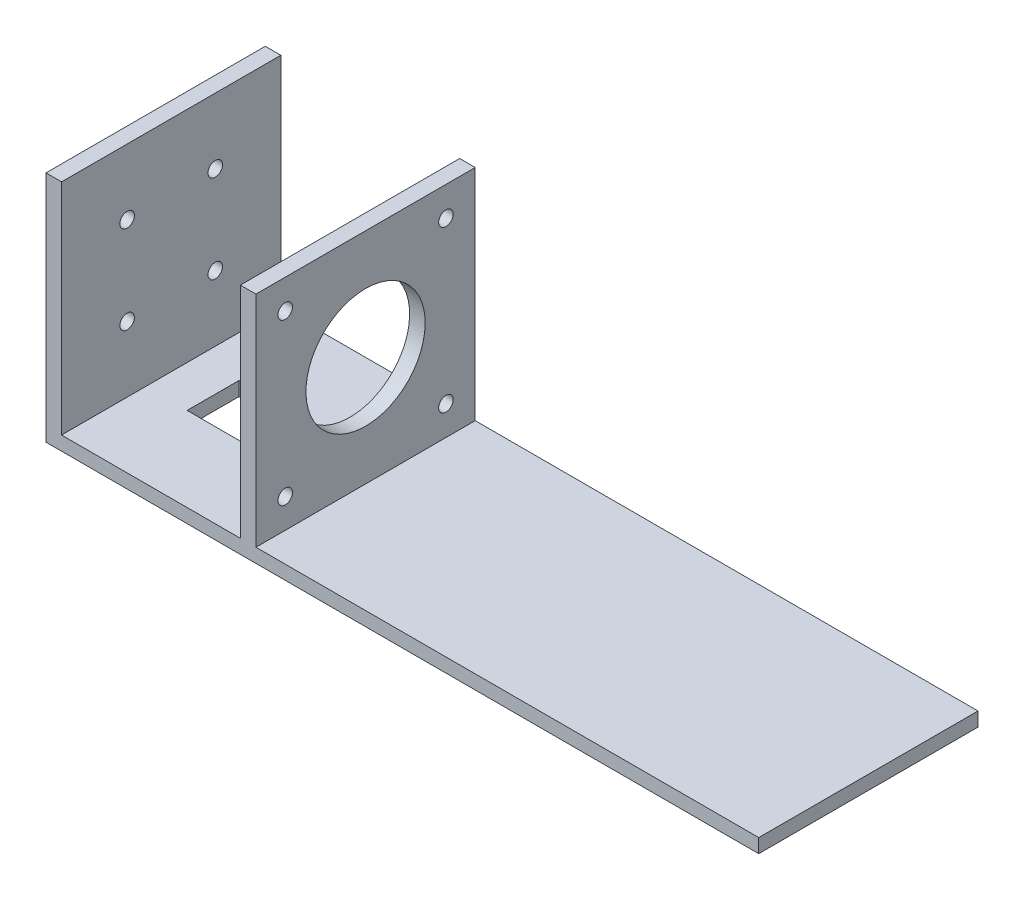
ISO-10303-21;
HEADER;
FILE_DESCRIPTION(('STEP AP214'),'2;1');
FILE_NAME('part.step','',(''),(''),'','','');
FILE_SCHEMA(('AUTOMOTIVE_DESIGN { 1 0 10303 214 1 1 1 1 }'));
ENDSEC;
DATA;
#1=APPLICATION_CONTEXT('core data for automotive mechanical design processes');
#2=APPLICATION_PROTOCOL_DEFINITION('international standard','automotive_design',2000,#1);
#3=PRODUCT_CONTEXT('',#1,'mechanical');
#4=PRODUCT('Part','Part','',(#3));
#5=PRODUCT_RELATED_PRODUCT_CATEGORY('part','',(#4));
#6=PRODUCT_DEFINITION_FORMATION('','',#4);
#7=PRODUCT_DEFINITION_CONTEXT('part definition',#1,'design');
#8=PRODUCT_DEFINITION('design','',#6,#7);
#9=PRODUCT_DEFINITION_SHAPE('','',#8);
#10=(LENGTH_UNIT() NAMED_UNIT(*) SI_UNIT(.MILLI.,.METRE.));
#11=(NAMED_UNIT(*) PLANE_ANGLE_UNIT() SI_UNIT($,.RADIAN.));
#12=(NAMED_UNIT(*) SI_UNIT($,.STERADIAN.) SOLID_ANGLE_UNIT());
#13=UNCERTAINTY_MEASURE_WITH_UNIT(LENGTH_MEASURE(1.E-05),#10,'distance_accuracy_value','');
#14=(GEOMETRIC_REPRESENTATION_CONTEXT(3) GLOBAL_UNCERTAINTY_ASSIGNED_CONTEXT((#13)) GLOBAL_UNIT_ASSIGNED_CONTEXT((#10,
#11,#12)) REPRESENTATION_CONTEXT('',''));
#15=CARTESIAN_POINT('',(0.,0.,0.));
#16=DIRECTION('',(0.,0.,1.));
#17=DIRECTION('',(1.,0.,0.));
#18=AXIS2_PLACEMENT_3D('',#15,#16,#17);
#19=CARTESIAN_POINT('',(97.25,-19.8,42.3));
#20=DIRECTION('',(-1.,0.,0.));
#21=DIRECTION('',(0.,-1.,0.));
#22=AXIS2_PLACEMENT_3D('',#19,#20,#21);
#23=PLANE('',#22);
#24=DIRECTION('',(0.,1.,0.));
#25=VECTOR('',#24,1.);
#26=CARTESIAN_POINT('',(97.25,-19.8,0.));
#27=LINE('',#26,#25);
#28=CARTESIAN_POINT('',(97.25,-22.5,0.));
#29=VERTEX_POINT('',#28);
#30=CARTESIAN_POINT('',(97.25,-19.8,0.));
#31=VERTEX_POINT('',#30);
#32=EDGE_CURVE('E214',#29,#31,#27,.T.);
#33=ORIENTED_EDGE('',*,*,#32,.T.);
#34=DIRECTION('',(0.,0.,-1.));
#35=VECTOR('',#34,1.);
#36=CARTESIAN_POINT('',(97.25,-19.8,42.3));
#37=LINE('',#36,#35);
#38=CARTESIAN_POINT('',(97.25,-19.8,42.3));
#39=VERTEX_POINT('',#38);
#40=EDGE_CURVE('E261',#39,#31,#37,.T.);
#41=ORIENTED_EDGE('',*,*,#40,.F.);
#42=DIRECTION('',(0.,1.,0.));
#43=VECTOR('',#42,1.);
#44=CARTESIAN_POINT('',(97.25,-19.8,42.3));
#45=LINE('',#44,#43);
#46=CARTESIAN_POINT('',(97.25,-22.5,42.3));
#47=VERTEX_POINT('',#46);
#48=EDGE_CURVE('E191',#47,#39,#45,.T.);
#49=ORIENTED_EDGE('',*,*,#48,.F.);
#50=DIRECTION('',(0.,0.,-1.));
#51=VECTOR('',#50,1.);
#52=CARTESIAN_POINT('',(97.25,-22.5,42.3));
#53=LINE('',#52,#51);
#54=EDGE_CURVE('E213',#47,#29,#53,.T.);
#55=ORIENTED_EDGE('',*,*,#54,.T.);
#56=EDGE_LOOP('',(#33,#41,#49,#55));
#57=FACE_BOUND('',#56,.T.);
#58=ADVANCED_FACE('F33',(#57),#23,.F.);
#59=CARTESIAN_POINT('',(0.250000000000015,-19.8,42.3));
#60=DIRECTION('',(0.,-1.,0.));
#61=DIRECTION('',(1.,0.,0.));
#62=AXIS2_PLACEMENT_3D('',#59,#60,#61);
#63=PLANE('',#62);
#64=DIRECTION('',(-1.,0.,0.));
#65=VECTOR('',#64,1.);
#66=CARTESIAN_POINT('',(0.250000000000015,-19.8,0.));
#67=LINE('',#66,#65);
#68=CARTESIAN_POINT('',(0.250000000000015,-19.8,0.));
#69=VERTEX_POINT('',#68);
#70=EDGE_CURVE('E217',#31,#69,#67,.T.);
#71=ORIENTED_EDGE('',*,*,#70,.T.);
#72=DIRECTION('',(0.,0.,-1.));
#73=VECTOR('',#72,1.);
#74=CARTESIAN_POINT('',(0.250000000000015,-19.8,42.3));
#75=LINE('',#74,#73);
#76=CARTESIAN_POINT('',(0.250000000000015,-19.8,42.3));
#77=VERTEX_POINT('',#76);
#78=EDGE_CURVE('E258',#77,#69,#75,.T.);
#79=ORIENTED_EDGE('',*,*,#78,.F.);
#80=DIRECTION('',(-1.,0.,0.));
#81=VECTOR('',#80,1.);
#82=CARTESIAN_POINT('',(0.250000000000015,-19.8,42.3));
#83=LINE('',#82,#81);
#84=EDGE_CURVE('E194',#39,#77,#83,.T.);
#85=ORIENTED_EDGE('',*,*,#84,.F.);
#86=ORIENTED_EDGE('',*,*,#40,.T.);
#87=EDGE_LOOP('',(#71,#79,#85,#86));
#88=FACE_BOUND('',#87,.T.);
#89=ADVANCED_FACE('F311',(#88),#63,.F.);
#90=CARTESIAN_POINT('',(0.250000000000004,22.5,42.3));
#91=DIRECTION('',(-1.,0.,0.));
#92=DIRECTION('',(0.,-1.,0.));
#93=AXIS2_PLACEMENT_3D('',#90,#91,#92);
#94=PLANE('',#93);
#95=CARTESIAN_POINT('',(0.250000000000014,-14.15,36.65));
#96=DIRECTION('',(1.,0.,0.));
#97=DIRECTION('',(0.,1.,0.));
#98=AXIS2_PLACEMENT_3D('',#95,#96,#97);
#99=CIRCLE('',#98,1.4);
#100=CARTESIAN_POINT('',(0.250000000000013,-12.75,36.65));
#101=VERTEX_POINT('',#100);
#102=EDGE_CURVE('E184',#101,#101,#99,.T.);
#103=ORIENTED_EDGE('',*,*,#102,.F.);
#104=EDGE_LOOP('',(#103));
#105=FACE_BOUND('',#104,.T.);
#106=CARTESIAN_POINT('',(0.250000000000014,-14.15,5.65));
#107=DIRECTION('',(1.,0.,0.));
#108=DIRECTION('',(0.,1.,0.));
#109=AXIS2_PLACEMENT_3D('',#106,#107,#108);
#110=CIRCLE('',#109,1.4);
#111=CARTESIAN_POINT('',(0.250000000000013,-12.75,5.65));
#112=VERTEX_POINT('',#111);
#113=EDGE_CURVE('E181',#112,#112,#110,.T.);
#114=ORIENTED_EDGE('',*,*,#113,.F.);
#115=EDGE_LOOP('',(#114));
#116=FACE_BOUND('',#115,.T.);
#117=CARTESIAN_POINT('',(0.250000000000006,16.85,5.65));
#118=DIRECTION('',(1.,0.,0.));
#119=DIRECTION('',(0.,1.,0.));
#120=AXIS2_PLACEMENT_3D('',#117,#118,#119);
#121=CIRCLE('',#120,1.4);
#122=CARTESIAN_POINT('',(0.250000000000005,18.25,5.65));
#123=VERTEX_POINT('',#122);
#124=EDGE_CURVE('E178',#123,#123,#121,.T.);
#125=ORIENTED_EDGE('',*,*,#124,.F.);
#126=EDGE_LOOP('',(#125));
#127=FACE_BOUND('',#126,.T.);
#128=CARTESIAN_POINT('',(0.250000000000006,16.85,36.65));
#129=DIRECTION('',(1.,0.,0.));
#130=DIRECTION('',(0.,1.,0.));
#131=AXIS2_PLACEMENT_3D('',#128,#129,#130);
#132=CIRCLE('',#131,1.4);
#133=CARTESIAN_POINT('',(0.250000000000005,18.25,36.65));
#134=VERTEX_POINT('',#133);
#135=EDGE_CURVE('E174',#134,#134,#132,.T.);
#136=ORIENTED_EDGE('',*,*,#135,.F.);
#137=EDGE_LOOP('',(#136));
#138=FACE_BOUND('',#137,.T.);
#139=CARTESIAN_POINT('',(0.25000000000001,1.35,21.15));
#140=DIRECTION('',(1.,0.,0.));
#141=DIRECTION('',(0.,1.,0.));
#142=AXIS2_PLACEMENT_3D('',#139,#140,#141);
#143=CIRCLE('',#142,11.5);
#144=CARTESIAN_POINT('',(0.250000000000007,12.85,21.15));
#145=VERTEX_POINT('',#144);
#146=EDGE_CURVE('E177',#145,#145,#143,.T.);
#147=ORIENTED_EDGE('',*,*,#146,.F.);
#148=EDGE_LOOP('',(#147));
#149=FACE_BOUND('',#148,.T.);
#150=DIRECTION('',(0.,1.,0.));
#151=VECTOR('',#150,1.);
#152=CARTESIAN_POINT('',(0.250000000000004,22.5,0.));
#153=LINE('',#152,#151);
#154=CARTESIAN_POINT('',(0.250000000000004,22.5,0.));
#155=VERTEX_POINT('',#154);
#156=EDGE_CURVE('E220',#69,#155,#153,.T.);
#157=ORIENTED_EDGE('',*,*,#156,.T.);
#158=DIRECTION('',(0.,0.,-1.));
#159=VECTOR('',#158,1.);
#160=CARTESIAN_POINT('',(0.250000000000004,22.5,42.3));
#161=LINE('',#160,#159);
#162=CARTESIAN_POINT('',(0.250000000000004,22.5,42.3));
#163=VERTEX_POINT('',#162);
#164=EDGE_CURVE('E255',#163,#155,#161,.T.);
#165=ORIENTED_EDGE('',*,*,#164,.F.);
#166=DIRECTION('',(0.,1.,0.));
#167=VECTOR('',#166,1.);
#168=CARTESIAN_POINT('',(0.250000000000004,22.5,42.3));
#169=LINE('',#168,#167);
#170=EDGE_CURVE('E197',#77,#163,#169,.T.);
#171=ORIENTED_EDGE('',*,*,#170,.F.);
#172=ORIENTED_EDGE('',*,*,#78,.T.);
#173=EDGE_LOOP('',(#157,#165,#171,#172));
#174=FACE_BOUND('',#173,.T.);
#175=ADVANCED_FACE('F316',(#105,#116,#127,#138,#149,#174),#94,.F.);
#176=CARTESIAN_POINT('',(-2.75,22.5,42.3));
#177=DIRECTION('',(0.,-1.,0.));
#178=DIRECTION('',(1.,0.,0.));
#179=AXIS2_PLACEMENT_3D('',#176,#177,#178);
#180=PLANE('',#179);
#181=DIRECTION('',(-1.,0.,0.));
#182=VECTOR('',#181,1.);
#183=CARTESIAN_POINT('',(-2.75,22.5,0.));
#184=LINE('',#183,#182);
#185=CARTESIAN_POINT('',(-2.75,22.5,0.));
#186=VERTEX_POINT('',#185);
#187=EDGE_CURVE('E222',#155,#186,#184,.T.);
#188=ORIENTED_EDGE('',*,*,#187,.T.);
#189=DIRECTION('',(0.,0.,-1.));
#190=VECTOR('',#189,1.);
#191=CARTESIAN_POINT('',(-2.75,22.5,42.3));
#192=LINE('',#191,#190);
#193=CARTESIAN_POINT('',(-2.75,22.5,42.3));
#194=VERTEX_POINT('',#193);
#195=EDGE_CURVE('E252',#194,#186,#192,.T.);
#196=ORIENTED_EDGE('',*,*,#195,.F.);
#197=DIRECTION('',(-1.,0.,0.));
#198=VECTOR('',#197,1.);
#199=CARTESIAN_POINT('',(-2.75,22.5,42.3));
#200=LINE('',#199,#198);
#201=EDGE_CURVE('E199',#163,#194,#200,.T.);
#202=ORIENTED_EDGE('',*,*,#201,.F.);
#203=ORIENTED_EDGE('',*,*,#164,.T.);
#204=EDGE_LOOP('',(#188,#196,#202,#203));
#205=FACE_BOUND('',#204,.T.);
#206=ADVANCED_FACE('F358',(#205),#180,.F.);
#207=CARTESIAN_POINT('',(-2.75,22.5,42.3));
#208=DIRECTION('',(1.,0.,0.));
#209=DIRECTION('',(0.,1.,0.));
#210=AXIS2_PLACEMENT_3D('',#207,#208,#209);
#211=PLANE('',#210);
#212=CARTESIAN_POINT('',(-2.74999999999999,-14.15,36.65));
#213=DIRECTION('',(1.,0.,0.));
#214=DIRECTION('',(0.,1.,0.));
#215=AXIS2_PLACEMENT_3D('',#212,#213,#214);
#216=CIRCLE('',#215,1.4);
#217=CARTESIAN_POINT('',(-2.74999999999999,-12.75,36.65));
#218=VERTEX_POINT('',#217);
#219=EDGE_CURVE('E218',#218,#218,#216,.T.);
#220=ORIENTED_EDGE('',*,*,#219,.T.);
#221=EDGE_LOOP('',(#220));
#222=FACE_BOUND('',#221,.T.);
#223=CARTESIAN_POINT('',(-2.74999999999999,-14.15,5.65));
#224=DIRECTION('',(1.,0.,0.));
#225=DIRECTION('',(0.,1.,0.));
#226=AXIS2_PLACEMENT_3D('',#223,#224,#225);
#227=CIRCLE('',#226,1.4);
#228=CARTESIAN_POINT('',(-2.74999999999999,-12.75,5.65));
#229=VERTEX_POINT('',#228);
#230=EDGE_CURVE('E273',#229,#229,#227,.T.);
#231=ORIENTED_EDGE('',*,*,#230,.T.);
#232=EDGE_LOOP('',(#231));
#233=FACE_BOUND('',#232,.T.);
#234=CARTESIAN_POINT('',(-2.74999999999999,16.85,5.65));
#235=DIRECTION('',(1.,0.,0.));
#236=DIRECTION('',(0.,1.,0.));
#237=AXIS2_PLACEMENT_3D('',#234,#235,#236);
#238=CIRCLE('',#237,1.4);
#239=CARTESIAN_POINT('',(-2.74999999999999,18.25,5.65));
#240=VERTEX_POINT('',#239);
#241=EDGE_CURVE('E270',#240,#240,#238,.T.);
#242=ORIENTED_EDGE('',*,*,#241,.T.);
#243=EDGE_LOOP('',(#242));
#244=FACE_BOUND('',#243,.T.);
#245=CARTESIAN_POINT('',(-2.74999999999999,16.85,36.65));
#246=DIRECTION('',(1.,0.,0.));
#247=DIRECTION('',(0.,1.,0.));
#248=AXIS2_PLACEMENT_3D('',#245,#246,#247);
#249=CIRCLE('',#248,1.4);
#250=CARTESIAN_POINT('',(-2.74999999999999,18.25,36.65));
#251=VERTEX_POINT('',#250);
#252=EDGE_CURVE('E267',#251,#251,#249,.T.);
#253=ORIENTED_EDGE('',*,*,#252,.T.);
#254=EDGE_LOOP('',(#253));
#255=FACE_BOUND('',#254,.T.);
#256=CARTESIAN_POINT('',(-2.74999999999999,1.35,21.15));
#257=DIRECTION('',(1.,0.,0.));
#258=DIRECTION('',(0.,1.,0.));
#259=AXIS2_PLACEMENT_3D('',#256,#257,#258);
#260=CIRCLE('',#259,11.5);
#261=CARTESIAN_POINT('',(-2.74999999999999,12.85,21.15));
#262=VERTEX_POINT('',#261);
#263=EDGE_CURVE('E190',#262,#262,#260,.T.);
#264=ORIENTED_EDGE('',*,*,#263,.T.);
#265=EDGE_LOOP('',(#264));
#266=FACE_BOUND('',#265,.T.);
#267=DIRECTION('',(0.,-1.,0.));
#268=VECTOR('',#267,1.);
#269=CARTESIAN_POINT('',(-2.75,22.5,0.));
#270=LINE('',#269,#268);
#271=CARTESIAN_POINT('',(-2.74999999999999,-19.8,0.));
#272=VERTEX_POINT('',#271);
#273=EDGE_CURVE('E224',#186,#272,#270,.T.);
#274=ORIENTED_EDGE('',*,*,#273,.T.);
#275=DIRECTION('',(0.,0.,-1.));
#276=VECTOR('',#275,1.);
#277=CARTESIAN_POINT('',(-2.74999999999999,-19.8,42.3));
#278=LINE('',#277,#276);
#279=CARTESIAN_POINT('',(-2.74999999999999,-19.8,42.3));
#280=VERTEX_POINT('',#279);
#281=EDGE_CURVE('E249',#280,#272,#278,.T.);
#282=ORIENTED_EDGE('',*,*,#281,.F.);
#283=DIRECTION('',(0.,-1.,0.));
#284=VECTOR('',#283,1.);
#285=CARTESIAN_POINT('',(-2.75,22.5,42.3));
#286=LINE('',#285,#284);
#287=EDGE_CURVE('E201',#194,#280,#286,.T.);
#288=ORIENTED_EDGE('',*,*,#287,.F.);
#289=ORIENTED_EDGE('',*,*,#195,.T.);
#290=EDGE_LOOP('',(#274,#282,#288,#289));
#291=FACE_BOUND('',#290,.T.);
#292=ADVANCED_FACE('F353',(#222,#233,#244,#255,#266,#291),#211,.F.);
#293=CARTESIAN_POINT('',(-37.25,-19.8,42.3));
#294=DIRECTION('',(0.,-1.,0.));
#295=DIRECTION('',(1.,0.,0.));
#296=AXIS2_PLACEMENT_3D('',#293,#294,#295);
#297=PLANE('',#296);
#298=DIRECTION('',(-1.,0.,0.));
#299=VECTOR('',#298,1.);
#300=CARTESIAN_POINT('',(-29.25,-19.8,16.0701220935394));
#301=LINE('',#300,#299);
#302=CARTESIAN_POINT('',(-9.25,-19.8,16.0701220935394));
#303=VERTEX_POINT('',#302);
#304=CARTESIAN_POINT('',(-29.25,-19.8,16.0701220935394));
#305=VERTEX_POINT('',#304);
#306=EDGE_CURVE('E145',#303,#305,#301,.T.);
#307=ORIENTED_EDGE('',*,*,#306,.F.);
#308=DIRECTION('',(0.,0.,-1.));
#309=VECTOR('',#308,1.);
#310=CARTESIAN_POINT('',(-9.25,-19.8,16.0701220935394));
#311=LINE('',#310,#309);
#312=CARTESIAN_POINT('',(-9.25,-19.8,26.0701220935394));
#313=VERTEX_POINT('',#312);
#314=EDGE_CURVE('E47',#313,#303,#311,.T.);
#315=ORIENTED_EDGE('',*,*,#314,.F.);
#316=DIRECTION('',(1.,0.,0.));
#317=VECTOR('',#316,1.);
#318=CARTESIAN_POINT('',(-29.25,-19.8,26.0701220935394));
#319=LINE('',#318,#317);
#320=CARTESIAN_POINT('',(-29.25,-19.8,26.0701220935394));
#321=VERTEX_POINT('',#320);
#322=EDGE_CURVE('E152',#321,#313,#319,.T.);
#323=ORIENTED_EDGE('',*,*,#322,.F.);
#324=DIRECTION('',(0.,0.,1.));
#325=VECTOR('',#324,1.);
#326=CARTESIAN_POINT('',(-29.25,-19.8,16.0701220935394));
#327=LINE('',#326,#325);
#328=EDGE_CURVE('E136',#305,#321,#327,.T.);
#329=ORIENTED_EDGE('',*,*,#328,.F.);
#330=EDGE_LOOP('',(#307,#315,#323,#329));
#331=FACE_BOUND('',#330,.T.);
#332=DIRECTION('',(-1.,0.,0.));
#333=VECTOR('',#332,1.);
#334=CARTESIAN_POINT('',(-37.25,-19.8,0.));
#335=LINE('',#334,#333);
#336=CARTESIAN_POINT('',(-37.25,-19.8,0.));
#337=VERTEX_POINT('',#336);
#338=EDGE_CURVE('E226',#272,#337,#335,.T.);
#339=ORIENTED_EDGE('',*,*,#338,.T.);
#340=DIRECTION('',(0.,0.,-1.));
#341=VECTOR('',#340,1.);
#342=CARTESIAN_POINT('',(-37.25,-19.8,42.3));
#343=LINE('',#342,#341);
#344=CARTESIAN_POINT('',(-37.25,-19.8,42.3));
#345=VERTEX_POINT('',#344);
#346=EDGE_CURVE('E246',#345,#337,#343,.T.);
#347=ORIENTED_EDGE('',*,*,#346,.F.);
#348=DIRECTION('',(-1.,0.,0.));
#349=VECTOR('',#348,1.);
#350=CARTESIAN_POINT('',(-37.25,-19.8,42.3));
#351=LINE('',#350,#349);
#352=EDGE_CURVE('E203',#280,#345,#351,.T.);
#353=ORIENTED_EDGE('',*,*,#352,.F.);
#354=ORIENTED_EDGE('',*,*,#281,.T.);
#355=EDGE_LOOP('',(#339,#347,#353,#354));
#356=FACE_BOUND('',#355,.T.);
#357=ADVANCED_FACE('F149',(#331,#356),#297,.F.);
#358=CARTESIAN_POINT('',(-37.25,22.5,42.3));
#359=DIRECTION('',(-1.,0.,0.));
#360=DIRECTION('',(0.,-1.,0.));
#361=AXIS2_PLACEMENT_3D('',#358,#359,#360);
#362=PLANE('',#361);
#363=CARTESIAN_POINT('',(-37.25,-7.14999999999991,29.6499999999999));
#364=DIRECTION('',(1.,0.,0.));
#365=DIRECTION('',(0.,1.,0.));
#366=AXIS2_PLACEMENT_3D('',#363,#364,#365);
#367=CIRCLE('',#366,1.4);
#368=CARTESIAN_POINT('',(-37.25,-5.74999999999991,29.6499999999999));
#369=VERTEX_POINT('',#368);
#370=EDGE_CURVE('E159',#369,#369,#367,.T.);
#371=ORIENTED_EDGE('',*,*,#370,.F.);
#372=EDGE_LOOP('',(#371));
#373=FACE_BOUND('',#372,.T.);
#374=CARTESIAN_POINT('',(-37.25,-7.14999999999984,12.6499999999998));
#375=DIRECTION('',(1.,0.,0.));
#376=DIRECTION('',(0.,1.,0.));
#377=AXIS2_PLACEMENT_3D('',#374,#375,#376);
#378=CIRCLE('',#377,1.4);
#379=CARTESIAN_POINT('',(-37.25,-5.74999999999984,12.6499999999998));
#380=VERTEX_POINT('',#379);
#381=EDGE_CURVE('E166',#380,#380,#378,.T.);
#382=ORIENTED_EDGE('',*,*,#381,.F.);
#383=EDGE_LOOP('',(#382));
#384=FACE_BOUND('',#383,.T.);
#385=CARTESIAN_POINT('',(-37.25,9.85000000000019,12.65));
#386=DIRECTION('',(1.,0.,0.));
#387=DIRECTION('',(0.,1.,0.));
#388=AXIS2_PLACEMENT_3D('',#385,#386,#387);
#389=CIRCLE('',#388,1.4);
#390=CARTESIAN_POINT('',(-37.25,11.2500000000002,12.65));
#391=VERTEX_POINT('',#390);
#392=EDGE_CURVE('E162',#391,#391,#389,.T.);
#393=ORIENTED_EDGE('',*,*,#392,.F.);
#394=EDGE_LOOP('',(#393));
#395=FACE_BOUND('',#394,.T.);
#396=CARTESIAN_POINT('',(-37.25,9.85,29.65));
#397=DIRECTION('',(1.,0.,0.));
#398=DIRECTION('',(0.,1.,0.));
#399=AXIS2_PLACEMENT_3D('',#396,#397,#398);
#400=CIRCLE('',#399,1.4);
#401=CARTESIAN_POINT('',(-37.25,11.25,29.65));
#402=VERTEX_POINT('',#401);
#403=EDGE_CURVE('E165',#402,#402,#400,.T.);
#404=ORIENTED_EDGE('',*,*,#403,.F.);
#405=EDGE_LOOP('',(#404));
#406=FACE_BOUND('',#405,.T.);
#407=DIRECTION('',(0.,1.,0.));
#408=VECTOR('',#407,1.);
#409=CARTESIAN_POINT('',(-37.25,22.5,0.));
#410=LINE('',#409,#408);
#411=CARTESIAN_POINT('',(-37.25,22.5,0.));
#412=VERTEX_POINT('',#411);
#413=EDGE_CURVE('E228',#337,#412,#410,.T.);
#414=ORIENTED_EDGE('',*,*,#413,.T.);
#415=DIRECTION('',(0.,0.,-1.));
#416=VECTOR('',#415,1.);
#417=CARTESIAN_POINT('',(-37.25,22.5,42.3));
#418=LINE('',#417,#416);
#419=CARTESIAN_POINT('',(-37.25,22.5,42.3));
#420=VERTEX_POINT('',#419);
#421=EDGE_CURVE('E243',#420,#412,#418,.T.);
#422=ORIENTED_EDGE('',*,*,#421,.F.);
#423=DIRECTION('',(0.,1.,0.));
#424=VECTOR('',#423,1.);
#425=CARTESIAN_POINT('',(-37.25,22.5,42.3));
#426=LINE('',#425,#424);
#427=EDGE_CURVE('E205',#345,#420,#426,.T.);
#428=ORIENTED_EDGE('',*,*,#427,.F.);
#429=ORIENTED_EDGE('',*,*,#346,.T.);
#430=EDGE_LOOP('',(#414,#422,#428,#429));
#431=FACE_BOUND('',#430,.T.);
#432=ADVANCED_FACE('F347',(#373,#384,#395,#406,#431),#362,.F.);
#433=CARTESIAN_POINT('',(-40.25,22.5,42.3));
#434=DIRECTION('',(0.,-1.,0.));
#435=DIRECTION('',(0.,0.,-1.));
#436=AXIS2_PLACEMENT_3D('',#433,#434,#435);
#437=PLANE('',#436);
#438=DIRECTION('',(-1.,0.,0.));
#439=VECTOR('',#438,1.);
#440=CARTESIAN_POINT('',(-40.25,22.5,0.));
#441=LINE('',#440,#439);
#442=CARTESIAN_POINT('',(-40.25,22.5,0.));
#443=VERTEX_POINT('',#442);
#444=EDGE_CURVE('E230',#412,#443,#441,.T.);
#445=ORIENTED_EDGE('',*,*,#444,.T.);
#446=DIRECTION('',(0.,0.,-1.));
#447=VECTOR('',#446,1.);
#448=CARTESIAN_POINT('',(-40.25,22.5,42.3));
#449=LINE('',#448,#447);
#450=CARTESIAN_POINT('',(-40.25,22.5,42.3));
#451=VERTEX_POINT('',#450);
#452=EDGE_CURVE('E240',#451,#443,#449,.T.);
#453=ORIENTED_EDGE('',*,*,#452,.F.);
#454=DIRECTION('',(-1.,0.,0.));
#455=VECTOR('',#454,1.);
#456=CARTESIAN_POINT('',(-40.25,22.5,42.3));
#457=LINE('',#456,#455);
#458=EDGE_CURVE('E207',#420,#451,#457,.T.);
#459=ORIENTED_EDGE('',*,*,#458,.F.);
#460=ORIENTED_EDGE('',*,*,#421,.T.);
#461=EDGE_LOOP('',(#445,#453,#459,#460));
#462=FACE_BOUND('',#461,.T.);
#463=ADVANCED_FACE('F342',(#462),#437,.F.);
#464=CARTESIAN_POINT('',(-40.25,22.5,42.3));
#465=DIRECTION('',(1.,0.,0.));
#466=DIRECTION('',(0.,1.,0.));
#467=AXIS2_PLACEMENT_3D('',#464,#465,#466);
#468=PLANE('',#467);
#469=CARTESIAN_POINT('',(-40.25,-7.14999999999991,29.6499999999999));
#470=DIRECTION('',(1.,0.,0.));
#471=DIRECTION('',(0.,1.,0.));
#472=AXIS2_PLACEMENT_3D('',#469,#470,#471);
#473=CIRCLE('',#472,1.4);
#474=CARTESIAN_POINT('',(-40.25,-5.74999999999991,29.6499999999999));
#475=VERTEX_POINT('',#474);
#476=EDGE_CURVE('E187',#475,#475,#473,.T.);
#477=ORIENTED_EDGE('',*,*,#476,.T.);
#478=EDGE_LOOP('',(#477));
#479=FACE_BOUND('',#478,.T.);
#480=CARTESIAN_POINT('',(-40.25,-7.14999999999984,12.6499999999998));
#481=DIRECTION('',(1.,0.,0.));
#482=DIRECTION('',(0.,1.,0.));
#483=AXIS2_PLACEMENT_3D('',#480,#481,#482);
#484=CIRCLE('',#483,1.4);
#485=CARTESIAN_POINT('',(-40.25,-5.74999999999984,12.6499999999998));
#486=VERTEX_POINT('',#485);
#487=EDGE_CURVE('E283',#486,#486,#484,.T.);
#488=ORIENTED_EDGE('',*,*,#487,.T.);
#489=EDGE_LOOP('',(#488));
#490=FACE_BOUND('',#489,.T.);
#491=CARTESIAN_POINT('',(-40.25,9.85000000000019,12.65));
#492=DIRECTION('',(1.,0.,0.));
#493=DIRECTION('',(0.,1.,0.));
#494=AXIS2_PLACEMENT_3D('',#491,#492,#493);
#495=CIRCLE('',#494,1.4);
#496=CARTESIAN_POINT('',(-40.25,11.2500000000002,12.65));
#497=VERTEX_POINT('',#496);
#498=EDGE_CURVE('E280',#497,#497,#495,.T.);
#499=ORIENTED_EDGE('',*,*,#498,.T.);
#500=EDGE_LOOP('',(#499));
#501=FACE_BOUND('',#500,.T.);
#502=CARTESIAN_POINT('',(-40.25,9.85,29.65));
#503=DIRECTION('',(1.,0.,0.));
#504=DIRECTION('',(0.,1.,0.));
#505=AXIS2_PLACEMENT_3D('',#502,#503,#504);
#506=CIRCLE('',#505,1.4);
#507=CARTESIAN_POINT('',(-40.25,11.25,29.65));
#508=VERTEX_POINT('',#507);
#509=EDGE_CURVE('E173',#508,#508,#506,.T.);
#510=ORIENTED_EDGE('',*,*,#509,.T.);
#511=EDGE_LOOP('',(#510));
#512=FACE_BOUND('',#511,.T.);
#513=DIRECTION('',(0.,-1.,0.));
#514=VECTOR('',#513,1.);
#515=CARTESIAN_POINT('',(-40.25,22.5,0.));
#516=LINE('',#515,#514);
#517=CARTESIAN_POINT('',(-40.25,-22.5,0.));
#518=VERTEX_POINT('',#517);
#519=EDGE_CURVE('E232',#443,#518,#516,.T.);
#520=ORIENTED_EDGE('',*,*,#519,.T.);
#521=DIRECTION('',(0.,0.,-1.));
#522=VECTOR('',#521,1.);
#523=CARTESIAN_POINT('',(-40.25,-22.5,42.3));
#524=LINE('',#523,#522);
#525=CARTESIAN_POINT('',(-40.25,-22.5,42.3));
#526=VERTEX_POINT('',#525);
#527=EDGE_CURVE('E237',#526,#518,#524,.T.);
#528=ORIENTED_EDGE('',*,*,#527,.F.);
#529=DIRECTION('',(0.,-1.,0.));
#530=VECTOR('',#529,1.);
#531=CARTESIAN_POINT('',(-40.25,22.5,42.3));
#532=LINE('',#531,#530);
#533=EDGE_CURVE('E209',#451,#526,#532,.T.);
#534=ORIENTED_EDGE('',*,*,#533,.F.);
#535=ORIENTED_EDGE('',*,*,#452,.T.);
#536=EDGE_LOOP('',(#520,#528,#534,#535));
#537=FACE_BOUND('',#536,.T.);
#538=ADVANCED_FACE('F336',(#479,#490,#501,#512,#537),#468,.F.);
#539=CARTESIAN_POINT('',(-40.25,-22.5,42.3));
#540=DIRECTION('',(0.,1.,0.));
#541=DIRECTION('',(0.,0.,1.));
#542=AXIS2_PLACEMENT_3D('',#539,#540,#541);
#543=PLANE('',#542);
#544=DIRECTION('',(1.,0.,0.));
#545=VECTOR('',#544,1.);
#546=CARTESIAN_POINT('',(-40.25,-22.5,26.0701220935394));
#547=LINE('',#546,#545);
#548=CARTESIAN_POINT('',(-29.25,-22.5,26.0701220935394));
#549=VERTEX_POINT('',#548);
#550=CARTESIAN_POINT('',(-9.25,-22.5,26.0701220935394));
#551=VERTEX_POINT('',#550);
#552=EDGE_CURVE('E40',#549,#551,#547,.T.);
#553=ORIENTED_EDGE('',*,*,#552,.T.);
#554=DIRECTION('',(0.,0.,-1.));
#555=VECTOR('',#554,1.);
#556=CARTESIAN_POINT('',(-9.24999999999999,-22.5,42.3));
#557=LINE('',#556,#555);
#558=CARTESIAN_POINT('',(-9.25,-22.5,16.0701220935394));
#559=VERTEX_POINT('',#558);
#560=EDGE_CURVE('E11',#551,#559,#557,.T.);
#561=ORIENTED_EDGE('',*,*,#560,.T.);
#562=DIRECTION('',(-1.,0.,0.));
#563=VECTOR('',#562,1.);
#564=CARTESIAN_POINT('',(-40.25,-22.5,16.0701220935394));
#565=LINE('',#564,#563);
#566=CARTESIAN_POINT('',(-29.25,-22.5,16.0701220935394));
#567=VERTEX_POINT('',#566);
#568=EDGE_CURVE('E264',#559,#567,#565,.T.);
#569=ORIENTED_EDGE('',*,*,#568,.T.);
#570=DIRECTION('',(0.,0.,1.));
#571=VECTOR('',#570,1.);
#572=CARTESIAN_POINT('',(-29.25,-22.5,42.3));
#573=LINE('',#572,#571);
#574=EDGE_CURVE('E139',#567,#549,#573,.T.);
#575=ORIENTED_EDGE('',*,*,#574,.T.);
#576=EDGE_LOOP('',(#553,#561,#569,#575));
#577=FACE_BOUND('',#576,.T.);
#578=DIRECTION('',(1.,0.,0.));
#579=VECTOR('',#578,1.);
#580=CARTESIAN_POINT('',(-40.25,-22.5,0.));
#581=LINE('',#580,#579);
#582=EDGE_CURVE('E195',#518,#29,#581,.T.);
#583=ORIENTED_EDGE('',*,*,#582,.T.);
#584=ORIENTED_EDGE('',*,*,#54,.F.);
#585=DIRECTION('',(1.,0.,0.));
#586=VECTOR('',#585,1.);
#587=CARTESIAN_POINT('',(-40.25,-22.5,42.3));
#588=LINE('',#587,#586);
#589=EDGE_CURVE('E211',#526,#47,#588,.T.);
#590=ORIENTED_EDGE('',*,*,#589,.F.);
#591=ORIENTED_EDGE('',*,*,#527,.T.);
#592=EDGE_LOOP('',(#583,#584,#590,#591));
#593=FACE_BOUND('',#592,.T.);
#594=ADVANCED_FACE('F291',(#577,#593),#543,.F.);
#595=CARTESIAN_POINT('',(0.,0.,42.3));
#596=DIRECTION('',(0.,0.,1.));
#597=DIRECTION('',(1.,0.,0.));
#598=AXIS2_PLACEMENT_3D('',#595,#596,#597);
#599=PLANE('',#598);
#600=ORIENTED_EDGE('',*,*,#48,.T.);
#601=ORIENTED_EDGE('',*,*,#84,.T.);
#602=ORIENTED_EDGE('',*,*,#170,.T.);
#603=ORIENTED_EDGE('',*,*,#201,.T.);
#604=ORIENTED_EDGE('',*,*,#287,.T.);
#605=ORIENTED_EDGE('',*,*,#352,.T.);
#606=ORIENTED_EDGE('',*,*,#427,.T.);
#607=ORIENTED_EDGE('',*,*,#458,.T.);
#608=ORIENTED_EDGE('',*,*,#533,.T.);
#609=ORIENTED_EDGE('',*,*,#589,.T.);
#610=EDGE_LOOP('',(#600,#601,#602,#603,#604,#605,#606,#607,#608,#609));
#611=FACE_BOUND('',#610,.T.);
#612=ADVANCED_FACE('F331',(#611),#599,.T.);
#613=CARTESIAN_POINT('',(0.,0.,0.));
#614=DIRECTION('',(0.,0.,1.));
#615=DIRECTION('',(1.,0.,0.));
#616=AXIS2_PLACEMENT_3D('',#613,#614,#615);
#617=PLANE('',#616);
#618=ORIENTED_EDGE('',*,*,#32,.F.);
#619=ORIENTED_EDGE('',*,*,#582,.F.);
#620=ORIENTED_EDGE('',*,*,#519,.F.);
#621=ORIENTED_EDGE('',*,*,#444,.F.);
#622=ORIENTED_EDGE('',*,*,#413,.F.);
#623=ORIENTED_EDGE('',*,*,#338,.F.);
#624=ORIENTED_EDGE('',*,*,#273,.F.);
#625=ORIENTED_EDGE('',*,*,#187,.F.);
#626=ORIENTED_EDGE('',*,*,#156,.F.);
#627=ORIENTED_EDGE('',*,*,#70,.F.);
#628=EDGE_LOOP('',(#618,#619,#620,#621,#622,#623,#624,#625,#626,#627));
#629=FACE_BOUND('',#628,.T.);
#630=ADVANCED_FACE('F324',(#629),#617,.F.);
#631=CARTESIAN_POINT('',(-4.74999999999999,1.35,21.15));
#632=DIRECTION('',(1.,0.,0.));
#633=DIRECTION('',(0.,1.,0.));
#634=AXIS2_PLACEMENT_3D('',#631,#632,#633);
#635=CYLINDRICAL_SURFACE('',#634,11.5);
#636=ORIENTED_EDGE('',*,*,#146,.T.);
#637=EDGE_LOOP('',(#636));
#638=FACE_BOUND('',#637,.T.);
#639=ORIENTED_EDGE('',*,*,#263,.F.);
#640=EDGE_LOOP('',(#639));
#641=FACE_BOUND('',#640,.T.);
#642=ADVANCED_FACE('F388',(#638,#641),#635,.F.);
#643=CARTESIAN_POINT('',(-4.74999999999999,16.85,36.65));
#644=DIRECTION('',(1.,0.,0.));
#645=DIRECTION('',(0.,1.,0.));
#646=AXIS2_PLACEMENT_3D('',#643,#644,#645);
#647=CYLINDRICAL_SURFACE('',#646,1.4);
#648=ORIENTED_EDGE('',*,*,#135,.T.);
#649=EDGE_LOOP('',(#648));
#650=FACE_BOUND('',#649,.T.);
#651=ORIENTED_EDGE('',*,*,#252,.F.);
#652=EDGE_LOOP('',(#651));
#653=FACE_BOUND('',#652,.T.);
#654=ADVANCED_FACE('F393',(#650,#653),#647,.F.);
#655=CARTESIAN_POINT('',(-4.74999999999999,16.85,5.65));
#656=DIRECTION('',(1.,0.,0.));
#657=DIRECTION('',(0.,1.,0.));
#658=AXIS2_PLACEMENT_3D('',#655,#656,#657);
#659=CYLINDRICAL_SURFACE('',#658,1.4);
#660=ORIENTED_EDGE('',*,*,#124,.T.);
#661=EDGE_LOOP('',(#660));
#662=FACE_BOUND('',#661,.T.);
#663=ORIENTED_EDGE('',*,*,#241,.F.);
#664=EDGE_LOOP('',(#663));
#665=FACE_BOUND('',#664,.T.);
#666=ADVANCED_FACE('F403',(#662,#665),#659,.F.);
#667=CARTESIAN_POINT('',(-4.74999999999999,-14.15,5.65));
#668=DIRECTION('',(1.,0.,0.));
#669=DIRECTION('',(0.,1.,0.));
#670=AXIS2_PLACEMENT_3D('',#667,#668,#669);
#671=CYLINDRICAL_SURFACE('',#670,1.4);
#672=ORIENTED_EDGE('',*,*,#113,.T.);
#673=EDGE_LOOP('',(#672));
#674=FACE_BOUND('',#673,.T.);
#675=ORIENTED_EDGE('',*,*,#230,.F.);
#676=EDGE_LOOP('',(#675));
#677=FACE_BOUND('',#676,.T.);
#678=ADVANCED_FACE('F399',(#674,#677),#671,.F.);
#679=CARTESIAN_POINT('',(-4.74999999999999,-14.15,36.65));
#680=DIRECTION('',(1.,0.,0.));
#681=DIRECTION('',(0.,1.,0.));
#682=AXIS2_PLACEMENT_3D('',#679,#680,#681);
#683=CYLINDRICAL_SURFACE('',#682,1.4);
#684=ORIENTED_EDGE('',*,*,#102,.T.);
#685=EDGE_LOOP('',(#684));
#686=FACE_BOUND('',#685,.T.);
#687=ORIENTED_EDGE('',*,*,#219,.F.);
#688=EDGE_LOOP('',(#687));
#689=FACE_BOUND('',#688,.T.);
#690=ADVANCED_FACE('F395',(#686,#689),#683,.F.);
#691=CARTESIAN_POINT('',(-42.25,9.85,29.65));
#692=DIRECTION('',(1.,0.,0.));
#693=DIRECTION('',(0.,1.,0.));
#694=AXIS2_PLACEMENT_3D('',#691,#692,#693);
#695=CYLINDRICAL_SURFACE('',#694,1.4);
#696=ORIENTED_EDGE('',*,*,#403,.T.);
#697=EDGE_LOOP('',(#696));
#698=FACE_BOUND('',#697,.T.);
#699=ORIENTED_EDGE('',*,*,#509,.F.);
#700=EDGE_LOOP('',(#699));
#701=FACE_BOUND('',#700,.T.);
#702=ADVANCED_FACE('F398',(#698,#701),#695,.F.);
#703=CARTESIAN_POINT('',(-42.25,9.85000000000019,12.65));
#704=DIRECTION('',(1.,0.,0.));
#705=DIRECTION('',(0.,1.,0.));
#706=AXIS2_PLACEMENT_3D('',#703,#704,#705);
#707=CYLINDRICAL_SURFACE('',#706,1.4);
#708=ORIENTED_EDGE('',*,*,#392,.T.);
#709=EDGE_LOOP('',(#708));
#710=FACE_BOUND('',#709,.T.);
#711=ORIENTED_EDGE('',*,*,#498,.F.);
#712=EDGE_LOOP('',(#711));
#713=FACE_BOUND('',#712,.T.);
#714=ADVANCED_FACE('F412',(#710,#713),#707,.F.);
#715=CARTESIAN_POINT('',(-42.25,-7.14999999999984,12.6499999999998));
#716=DIRECTION('',(1.,0.,0.));
#717=DIRECTION('',(0.,1.,0.));
#718=AXIS2_PLACEMENT_3D('',#715,#716,#717);
#719=CYLINDRICAL_SURFACE('',#718,1.4);
#720=ORIENTED_EDGE('',*,*,#381,.T.);
#721=EDGE_LOOP('',(#720));
#722=FACE_BOUND('',#721,.T.);
#723=ORIENTED_EDGE('',*,*,#487,.F.);
#724=EDGE_LOOP('',(#723));
#725=FACE_BOUND('',#724,.T.);
#726=ADVANCED_FACE('F305',(#722,#725),#719,.F.);
#727=CARTESIAN_POINT('',(-42.25,-7.14999999999991,29.6499999999999));
#728=DIRECTION('',(1.,0.,0.));
#729=DIRECTION('',(0.,1.,0.));
#730=AXIS2_PLACEMENT_3D('',#727,#728,#729);
#731=CYLINDRICAL_SURFACE('',#730,1.4);
#732=ORIENTED_EDGE('',*,*,#370,.T.);
#733=EDGE_LOOP('',(#732));
#734=FACE_BOUND('',#733,.T.);
#735=ORIENTED_EDGE('',*,*,#476,.F.);
#736=EDGE_LOOP('',(#735));
#737=FACE_BOUND('',#736,.T.);
#738=ADVANCED_FACE('F298',(#734,#737),#731,.F.);
#739=CARTESIAN_POINT('',(-9.25,-24.8,16.0701220935394));
#740=DIRECTION('',(1.,0.,0.));
#741=DIRECTION('',(0.,1.,0.));
#742=AXIS2_PLACEMENT_3D('',#739,#740,#741);
#743=PLANE('',#742);
#744=DIRECTION('',(0.,1.,0.));
#745=VECTOR('',#744,1.);
#746=CARTESIAN_POINT('',(-9.25,-24.8,26.0701220935394));
#747=LINE('',#746,#745);
#748=EDGE_CURVE('E157',#551,#313,#747,.T.);
#749=ORIENTED_EDGE('',*,*,#748,.T.);
#750=ORIENTED_EDGE('',*,*,#314,.T.);
#751=DIRECTION('',(0.,1.,0.));
#752=VECTOR('',#751,1.);
#753=CARTESIAN_POINT('',(-9.25,-24.8,16.0701220935394));
#754=LINE('',#753,#752);
#755=EDGE_CURVE('E142',#559,#303,#754,.T.);
#756=ORIENTED_EDGE('',*,*,#755,.F.);
#757=ORIENTED_EDGE('',*,*,#560,.F.);
#758=EDGE_LOOP('',(#749,#750,#756,#757));
#759=FACE_BOUND('',#758,.T.);
#760=ADVANCED_FACE('F296',(#759),#743,.F.);
#761=CARTESIAN_POINT('',(-29.25,-24.8,26.0701220935394));
#762=DIRECTION('',(0.,0.,1.));
#763=DIRECTION('',(1.,0.,0.));
#764=AXIS2_PLACEMENT_3D('',#761,#762,#763);
#765=PLANE('',#764);
#766=DIRECTION('',(0.,1.,0.));
#767=VECTOR('',#766,1.);
#768=CARTESIAN_POINT('',(-29.25,-24.8,26.0701220935394));
#769=LINE('',#768,#767);
#770=EDGE_CURVE('E141',#549,#321,#769,.T.);
#771=ORIENTED_EDGE('',*,*,#770,.T.);
#772=ORIENTED_EDGE('',*,*,#322,.T.);
#773=ORIENTED_EDGE('',*,*,#748,.F.);
#774=ORIENTED_EDGE('',*,*,#552,.F.);
#775=EDGE_LOOP('',(#771,#772,#773,#774));
#776=FACE_BOUND('',#775,.T.);
#777=ADVANCED_FACE('F295',(#776),#765,.F.);
#778=CARTESIAN_POINT('',(-29.25,-24.8,16.0701220935394));
#779=DIRECTION('',(-1.,0.,0.));
#780=DIRECTION('',(0.,0.,1.));
#781=AXIS2_PLACEMENT_3D('',#778,#779,#780);
#782=PLANE('',#781);
#783=DIRECTION('',(0.,1.,0.));
#784=VECTOR('',#783,1.);
#785=CARTESIAN_POINT('',(-29.25,-24.8,16.0701220935394));
#786=LINE('',#785,#784);
#787=EDGE_CURVE('E55',#567,#305,#786,.T.);
#788=ORIENTED_EDGE('',*,*,#787,.T.);
#789=ORIENTED_EDGE('',*,*,#328,.T.);
#790=ORIENTED_EDGE('',*,*,#770,.F.);
#791=ORIENTED_EDGE('',*,*,#574,.F.);
#792=EDGE_LOOP('',(#788,#789,#790,#791));
#793=FACE_BOUND('',#792,.T.);
#794=ADVANCED_FACE('F133',(#793),#782,.F.);
#795=CARTESIAN_POINT('',(-29.25,-24.8,16.0701220935394));
#796=DIRECTION('',(0.,0.,-1.));
#797=DIRECTION('',(-1.,0.,0.));
#798=AXIS2_PLACEMENT_3D('',#795,#796,#797);
#799=PLANE('',#798);
#800=ORIENTED_EDGE('',*,*,#755,.T.);
#801=ORIENTED_EDGE('',*,*,#306,.T.);
#802=ORIENTED_EDGE('',*,*,#787,.F.);
#803=ORIENTED_EDGE('',*,*,#568,.F.);
#804=EDGE_LOOP('',(#800,#801,#802,#803));
#805=FACE_BOUND('',#804,.T.);
#806=ADVANCED_FACE('F146',(#805),#799,.F.);
#807=CLOSED_SHELL('',(#58,#89,#175,#206,#292,#357,#432,#463,#538,#594,#612,#630,#642,#654,#666,
#678,#690,#702,#714,#726,#738,#760,#777,#794,#806));
#808=MANIFOLD_SOLID_BREP('B2',#807);
#809=ADVANCED_BREP_SHAPE_REPRESENTATION('',(#18,#808),#14);
#810=SHAPE_DEFINITION_REPRESENTATION(#9,#809);
ENDSEC;
END-ISO-10303-21;
